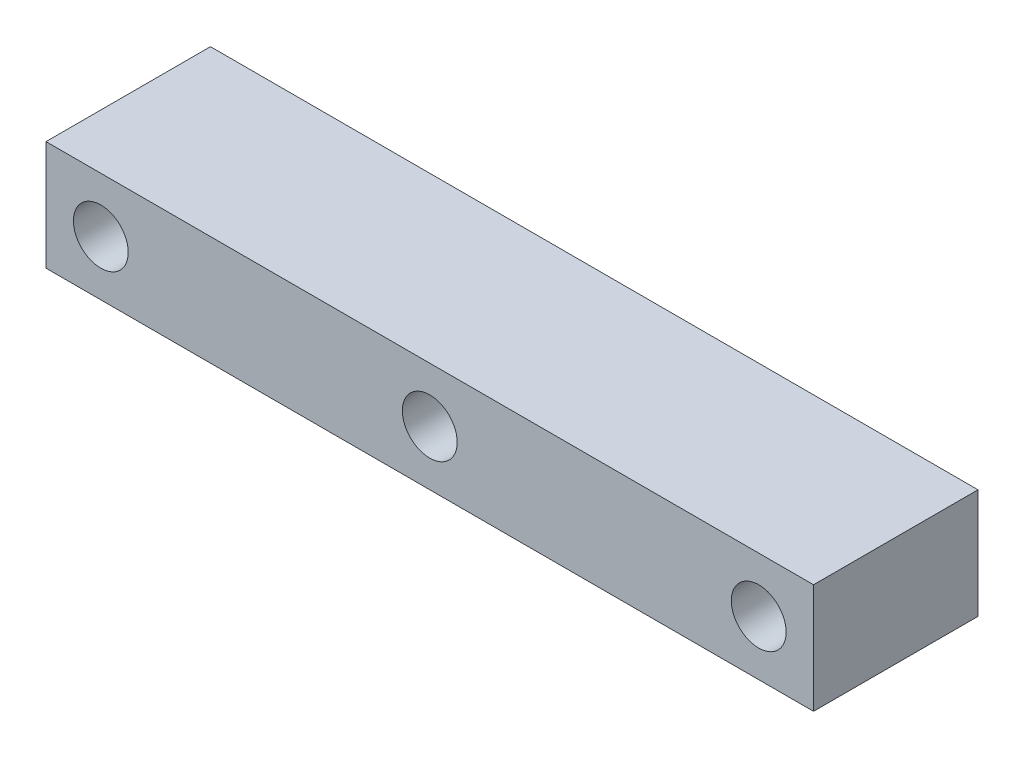
ISO-10303-21;
HEADER;
FILE_DESCRIPTION(('STEP AP214'),'2;1');
FILE_NAME('part.step','',(''),(''),'','','');
FILE_SCHEMA(('AUTOMOTIVE_DESIGN { 1 0 10303 214 1 1 1 1 }'));
ENDSEC;
DATA;
#1=APPLICATION_CONTEXT('core data for automotive mechanical design processes');
#2=APPLICATION_PROTOCOL_DEFINITION('international standard','automotive_design',2000,#1);
#3=PRODUCT_CONTEXT('',#1,'mechanical');
#4=PRODUCT('Part','Part','',(#3));
#5=PRODUCT_RELATED_PRODUCT_CATEGORY('part','',(#4));
#6=PRODUCT_DEFINITION_FORMATION('','',#4);
#7=PRODUCT_DEFINITION_CONTEXT('part definition',#1,'design');
#8=PRODUCT_DEFINITION('design','',#6,#7);
#9=PRODUCT_DEFINITION_SHAPE('','',#8);
#10=(LENGTH_UNIT() NAMED_UNIT(*) SI_UNIT(.MILLI.,.METRE.));
#11=(NAMED_UNIT(*) PLANE_ANGLE_UNIT() SI_UNIT($,.RADIAN.));
#12=(NAMED_UNIT(*) SI_UNIT($,.STERADIAN.) SOLID_ANGLE_UNIT());
#13=UNCERTAINTY_MEASURE_WITH_UNIT(LENGTH_MEASURE(1.E-05),#10,'distance_accuracy_value','');
#14=(GEOMETRIC_REPRESENTATION_CONTEXT(3) GLOBAL_UNCERTAINTY_ASSIGNED_CONTEXT((#13)) GLOBAL_UNIT_ASSIGNED_CONTEXT((#10,
#11,#12)) REPRESENTATION_CONTEXT('',''));
#15=CARTESIAN_POINT('',(0.,0.,0.));
#16=DIRECTION('',(0.,0.,1.));
#17=DIRECTION('',(1.,0.,0.));
#18=AXIS2_PLACEMENT_3D('',#15,#16,#17);
#19=CARTESIAN_POINT('',(0.,0.,38.1));
#20=DIRECTION('',(0.,0.,1.));
#21=DIRECTION('',(1.,0.,0.));
#22=AXIS2_PLACEMENT_3D('',#19,#20,#21);
#23=PLANE('',#22);
#24=CARTESIAN_POINT('',(0.,0.,38.1));
#25=DIRECTION('',(0.,0.,1.));
#26=DIRECTION('',(1.,0.,0.));
#27=AXIS2_PLACEMENT_3D('',#24,#25,#26);
#28=CIRCLE('',#27,6.35);
#29=CARTESIAN_POINT('',(6.35,0.,38.1));
#30=VERTEX_POINT('',#29);
#31=EDGE_CURVE('E118',#30,#30,#28,.T.);
#32=ORIENTED_EDGE('',*,*,#31,.F.);
#33=EDGE_LOOP('',(#32));
#34=FACE_BOUND('',#33,.T.);
#35=DIRECTION('',(0.,-1.,0.));
#36=VECTOR('',#35,1.);
#37=CARTESIAN_POINT('',(-88.9,12.7,38.1));
#38=LINE('',#37,#36);
#39=CARTESIAN_POINT('',(-88.9,12.7,38.1));
#40=VERTEX_POINT('',#39);
#41=CARTESIAN_POINT('',(-88.9,-12.7,38.1));
#42=VERTEX_POINT('',#41);
#43=EDGE_CURVE('E88',#40,#42,#38,.T.);
#44=ORIENTED_EDGE('',*,*,#43,.T.);
#45=DIRECTION('',(1.,0.,0.));
#46=VECTOR('',#45,1.);
#47=CARTESIAN_POINT('',(-88.9,-12.7,38.1));
#48=LINE('',#47,#46);
#49=CARTESIAN_POINT('',(88.9,-12.7,38.1));
#50=VERTEX_POINT('',#49);
#51=EDGE_CURVE('E83',#42,#50,#48,.T.);
#52=ORIENTED_EDGE('',*,*,#51,.T.);
#53=DIRECTION('',(0.,1.,0.));
#54=VECTOR('',#53,1.);
#55=CARTESIAN_POINT('',(88.9,12.7,38.1));
#56=LINE('',#55,#54);
#57=CARTESIAN_POINT('',(88.9,12.7,38.1));
#58=VERTEX_POINT('',#57);
#59=EDGE_CURVE('E86',#50,#58,#56,.T.);
#60=ORIENTED_EDGE('',*,*,#59,.T.);
#61=DIRECTION('',(-1.,0.,0.));
#62=VECTOR('',#61,1.);
#63=CARTESIAN_POINT('',(-88.9,12.7,38.1));
#64=LINE('',#63,#62);
#65=EDGE_CURVE('E53',#58,#40,#64,.T.);
#66=ORIENTED_EDGE('',*,*,#65,.T.);
#67=EDGE_LOOP('',(#44,#52,#60,#66));
#68=FACE_BOUND('',#67,.T.);
#69=CARTESIAN_POINT('',(-76.2,0.,38.1));
#70=DIRECTION('',(0.,0.,1.));
#71=DIRECTION('',(1.,0.,0.));
#72=AXIS2_PLACEMENT_3D('',#69,#70,#71);
#73=CIRCLE('',#72,6.35);
#74=CARTESIAN_POINT('',(-69.85,0.,38.1));
#75=VERTEX_POINT('',#74);
#76=EDGE_CURVE('E103',#75,#75,#73,.T.);
#77=ORIENTED_EDGE('',*,*,#76,.F.);
#78=EDGE_LOOP('',(#77));
#79=FACE_BOUND('',#78,.T.);
#80=CARTESIAN_POINT('',(76.2,0.,38.1));
#81=DIRECTION('',(0.,0.,1.));
#82=DIRECTION('',(1.,0.,0.));
#83=AXIS2_PLACEMENT_3D('',#80,#81,#82);
#84=CIRCLE('',#83,6.35);
#85=CARTESIAN_POINT('',(82.55,0.,38.1));
#86=VERTEX_POINT('',#85);
#87=EDGE_CURVE('E124',#86,#86,#84,.T.);
#88=ORIENTED_EDGE('',*,*,#87,.F.);
#89=EDGE_LOOP('',(#88));
#90=FACE_BOUND('',#89,.T.);
#91=ADVANCED_FACE('F36',(#34,#68,#79,#90),#23,.T.);
#92=CARTESIAN_POINT('',(0.,0.,0.));
#93=DIRECTION('',(0.,0.,1.));
#94=DIRECTION('',(1.,0.,0.));
#95=AXIS2_PLACEMENT_3D('',#92,#93,#94);
#96=PLANE('',#95);
#97=DIRECTION('',(0.,-1.,0.));
#98=VECTOR('',#97,1.);
#99=CARTESIAN_POINT('',(-88.9,12.7,0.));
#100=LINE('',#99,#98);
#101=CARTESIAN_POINT('',(-88.9,12.7,0.));
#102=VERTEX_POINT('',#101);
#103=CARTESIAN_POINT('',(-88.9,-12.7,0.));
#104=VERTEX_POINT('',#103);
#105=EDGE_CURVE('E100',#102,#104,#100,.T.);
#106=ORIENTED_EDGE('',*,*,#105,.F.);
#107=DIRECTION('',(-1.,0.,0.));
#108=VECTOR('',#107,1.);
#109=CARTESIAN_POINT('',(-88.9,12.7,0.));
#110=LINE('',#109,#108);
#111=CARTESIAN_POINT('',(88.9,12.7,0.));
#112=VERTEX_POINT('',#111);
#113=EDGE_CURVE('E76',#112,#102,#110,.T.);
#114=ORIENTED_EDGE('',*,*,#113,.F.);
#115=DIRECTION('',(0.,1.,0.));
#116=VECTOR('',#115,1.);
#117=CARTESIAN_POINT('',(88.9,12.7,0.));
#118=LINE('',#117,#116);
#119=CARTESIAN_POINT('',(88.9,-12.7,0.));
#120=VERTEX_POINT('',#119);
#121=EDGE_CURVE('E70',#120,#112,#118,.T.);
#122=ORIENTED_EDGE('',*,*,#121,.F.);
#123=DIRECTION('',(1.,0.,0.));
#124=VECTOR('',#123,1.);
#125=CARTESIAN_POINT('',(-88.9,-12.7,0.));
#126=LINE('',#125,#124);
#127=EDGE_CURVE('E92',#104,#120,#126,.T.);
#128=ORIENTED_EDGE('',*,*,#127,.F.);
#129=EDGE_LOOP('',(#106,#114,#122,#128));
#130=FACE_BOUND('',#129,.T.);
#131=CARTESIAN_POINT('',(-76.2,0.,0.));
#132=DIRECTION('',(0.,0.,1.));
#133=DIRECTION('',(1.,0.,0.));
#134=AXIS2_PLACEMENT_3D('',#131,#132,#133);
#135=CIRCLE('',#134,6.35);
#136=CARTESIAN_POINT('',(-69.85,0.,0.));
#137=VERTEX_POINT('',#136);
#138=EDGE_CURVE('E115',#137,#137,#135,.T.);
#139=ORIENTED_EDGE('',*,*,#138,.T.);
#140=EDGE_LOOP('',(#139));
#141=FACE_BOUND('',#140,.T.);
#142=CARTESIAN_POINT('',(0.,0.,0.));
#143=DIRECTION('',(0.,0.,1.));
#144=DIRECTION('',(1.,0.,0.));
#145=AXIS2_PLACEMENT_3D('',#142,#143,#144);
#146=CIRCLE('',#145,6.35);
#147=CARTESIAN_POINT('',(6.35,0.,0.));
#148=VERTEX_POINT('',#147);
#149=EDGE_CURVE('E121',#148,#148,#146,.T.);
#150=ORIENTED_EDGE('',*,*,#149,.T.);
#151=EDGE_LOOP('',(#150));
#152=FACE_BOUND('',#151,.T.);
#153=CARTESIAN_POINT('',(76.2,0.,0.));
#154=DIRECTION('',(0.,0.,1.));
#155=DIRECTION('',(1.,0.,0.));
#156=AXIS2_PLACEMENT_3D('',#153,#154,#155);
#157=CIRCLE('',#156,6.35);
#158=CARTESIAN_POINT('',(82.55,0.,0.));
#159=VERTEX_POINT('',#158);
#160=EDGE_CURVE('E127',#159,#159,#157,.T.);
#161=ORIENTED_EDGE('',*,*,#160,.T.);
#162=EDGE_LOOP('',(#161));
#163=FACE_BOUND('',#162,.T.);
#164=ADVANCED_FACE('F111',(#130,#141,#152,#163),#96,.F.);
#165=CARTESIAN_POINT('',(-88.9,12.7,38.1));
#166=DIRECTION('',(1.,0.,0.));
#167=DIRECTION('',(0.,0.,-1.));
#168=AXIS2_PLACEMENT_3D('',#165,#166,#167);
#169=PLANE('',#168);
#170=ORIENTED_EDGE('',*,*,#105,.T.);
#171=DIRECTION('',(0.,0.,-1.));
#172=VECTOR('',#171,1.);
#173=CARTESIAN_POINT('',(-88.9,-12.7,38.1));
#174=LINE('',#173,#172);
#175=EDGE_CURVE('E11',#42,#104,#174,.T.);
#176=ORIENTED_EDGE('',*,*,#175,.F.);
#177=ORIENTED_EDGE('',*,*,#43,.F.);
#178=DIRECTION('',(0.,0.,-1.));
#179=VECTOR('',#178,1.);
#180=CARTESIAN_POINT('',(-88.9,12.7,38.1));
#181=LINE('',#180,#179);
#182=EDGE_CURVE('E96',#40,#102,#181,.T.);
#183=ORIENTED_EDGE('',*,*,#182,.T.);
#184=EDGE_LOOP('',(#170,#176,#177,#183));
#185=FACE_BOUND('',#184,.T.);
#186=ADVANCED_FACE('F38',(#185),#169,.F.);
#187=CARTESIAN_POINT('',(-88.9,-12.7,38.1));
#188=DIRECTION('',(0.,1.,0.));
#189=DIRECTION('',(-1.,0.,0.));
#190=AXIS2_PLACEMENT_3D('',#187,#188,#189);
#191=PLANE('',#190);
#192=ORIENTED_EDGE('',*,*,#127,.T.);
#193=DIRECTION('',(0.,0.,-1.));
#194=VECTOR('',#193,1.);
#195=CARTESIAN_POINT('',(88.9,-12.7,38.1));
#196=LINE('',#195,#194);
#197=EDGE_CURVE('E45',#50,#120,#196,.T.);
#198=ORIENTED_EDGE('',*,*,#197,.F.);
#199=ORIENTED_EDGE('',*,*,#51,.F.);
#200=ORIENTED_EDGE('',*,*,#175,.T.);
#201=EDGE_LOOP('',(#192,#198,#199,#200));
#202=FACE_BOUND('',#201,.T.);
#203=ADVANCED_FACE('F91',(#202),#191,.F.);
#204=CARTESIAN_POINT('',(88.9,12.7,38.1));
#205=DIRECTION('',(-1.,0.,0.));
#206=DIRECTION('',(0.,0.,1.));
#207=AXIS2_PLACEMENT_3D('',#204,#205,#206);
#208=PLANE('',#207);
#209=ORIENTED_EDGE('',*,*,#121,.T.);
#210=DIRECTION('',(0.,0.,-1.));
#211=VECTOR('',#210,1.);
#212=CARTESIAN_POINT('',(88.9,12.7,38.1));
#213=LINE('',#212,#211);
#214=EDGE_CURVE('E93',#58,#112,#213,.T.);
#215=ORIENTED_EDGE('',*,*,#214,.F.);
#216=ORIENTED_EDGE('',*,*,#59,.F.);
#217=ORIENTED_EDGE('',*,*,#197,.T.);
#218=EDGE_LOOP('',(#209,#215,#216,#217));
#219=FACE_BOUND('',#218,.T.);
#220=ADVANCED_FACE('F94',(#219),#208,.F.);
#221=CARTESIAN_POINT('',(-88.9,12.7,38.1));
#222=DIRECTION('',(0.,-1.,0.));
#223=DIRECTION('',(0.,0.,-1.));
#224=AXIS2_PLACEMENT_3D('',#221,#222,#223);
#225=PLANE('',#224);
#226=ORIENTED_EDGE('',*,*,#113,.T.);
#227=ORIENTED_EDGE('',*,*,#182,.F.);
#228=ORIENTED_EDGE('',*,*,#65,.F.);
#229=ORIENTED_EDGE('',*,*,#214,.T.);
#230=EDGE_LOOP('',(#226,#227,#228,#229));
#231=FACE_BOUND('',#230,.T.);
#232=ADVANCED_FACE('F108',(#231),#225,.F.);
#233=CARTESIAN_POINT('',(-76.2,0.,38.1));
#234=DIRECTION('',(0.,0.,-1.));
#235=DIRECTION('',(-1.,0.,0.));
#236=AXIS2_PLACEMENT_3D('',#233,#234,#235);
#237=CYLINDRICAL_SURFACE('',#236,6.35);
#238=ORIENTED_EDGE('',*,*,#76,.T.);
#239=EDGE_LOOP('',(#238));
#240=FACE_BOUND('',#239,.T.);
#241=ORIENTED_EDGE('',*,*,#138,.F.);
#242=EDGE_LOOP('',(#241));
#243=FACE_BOUND('',#242,.T.);
#244=ADVANCED_FACE('F145',(#240,#243),#237,.F.);
#245=CARTESIAN_POINT('',(0.,0.,38.1));
#246=DIRECTION('',(0.,0.,-1.));
#247=DIRECTION('',(-1.,0.,0.));
#248=AXIS2_PLACEMENT_3D('',#245,#246,#247);
#249=CYLINDRICAL_SURFACE('',#248,6.35);
#250=ORIENTED_EDGE('',*,*,#31,.T.);
#251=EDGE_LOOP('',(#250));
#252=FACE_BOUND('',#251,.T.);
#253=ORIENTED_EDGE('',*,*,#149,.F.);
#254=EDGE_LOOP('',(#253));
#255=FACE_BOUND('',#254,.T.);
#256=ADVANCED_FACE('F191',(#252,#255),#249,.F.);
#257=CARTESIAN_POINT('',(76.2,0.,38.1));
#258=DIRECTION('',(0.,0.,-1.));
#259=DIRECTION('',(-1.,0.,0.));
#260=AXIS2_PLACEMENT_3D('',#257,#258,#259);
#261=CYLINDRICAL_SURFACE('',#260,6.35);
#262=ORIENTED_EDGE('',*,*,#87,.T.);
#263=EDGE_LOOP('',(#262));
#264=FACE_BOUND('',#263,.T.);
#265=ORIENTED_EDGE('',*,*,#160,.F.);
#266=EDGE_LOOP('',(#265));
#267=FACE_BOUND('',#266,.T.);
#268=ADVANCED_FACE('F133',(#264,#267),#261,.F.);
#269=CLOSED_SHELL('',(#91,#164,#186,#203,#220,#232,#244,#256,#268));
#270=MANIFOLD_SOLID_BREP('B2',#269);
#271=ADVANCED_BREP_SHAPE_REPRESENTATION('',(#18,#270),#14);
#272=SHAPE_DEFINITION_REPRESENTATION(#9,#271);
ENDSEC;
END-ISO-10303-21;
